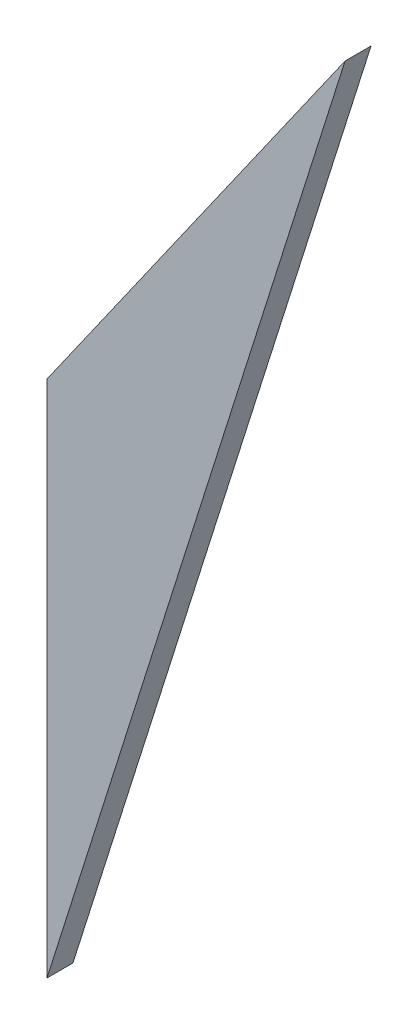
ISO-10303-21;
HEADER;
FILE_DESCRIPTION(('STEP AP214'),'2;1');
FILE_NAME('part.step','',(''),(''),'','','');
FILE_SCHEMA(('AUTOMOTIVE_DESIGN { 1 0 10303 214 1 1 1 1 }'));
ENDSEC;
DATA;
#1=APPLICATION_CONTEXT('core data for automotive mechanical design processes');
#2=APPLICATION_PROTOCOL_DEFINITION('international standard','automotive_design',2000,#1);
#3=PRODUCT_CONTEXT('',#1,'mechanical');
#4=PRODUCT('Part','Part','',(#3));
#5=PRODUCT_RELATED_PRODUCT_CATEGORY('part','',(#4));
#6=PRODUCT_DEFINITION_FORMATION('','',#4);
#7=PRODUCT_DEFINITION_CONTEXT('part definition',#1,'design');
#8=PRODUCT_DEFINITION('design','',#6,#7);
#9=PRODUCT_DEFINITION_SHAPE('','',#8);
#10=(LENGTH_UNIT() NAMED_UNIT(*) SI_UNIT(.MILLI.,.METRE.));
#11=(NAMED_UNIT(*) PLANE_ANGLE_UNIT() SI_UNIT($,.RADIAN.));
#12=(NAMED_UNIT(*) SI_UNIT($,.STERADIAN.) SOLID_ANGLE_UNIT());
#13=UNCERTAINTY_MEASURE_WITH_UNIT(LENGTH_MEASURE(1.E-05),#10,'distance_accuracy_value','');
#14=(GEOMETRIC_REPRESENTATION_CONTEXT(3) GLOBAL_UNCERTAINTY_ASSIGNED_CONTEXT((#13)) GLOBAL_UNIT_ASSIGNED_CONTEXT((#10,
#11,#12)) REPRESENTATION_CONTEXT('',''));
#15=CARTESIAN_POINT('',(0.,0.,0.));
#16=DIRECTION('',(0.,0.,1.));
#17=DIRECTION('',(1.,0.,0.));
#18=AXIS2_PLACEMENT_3D('',#15,#16,#17);
#19=CARTESIAN_POINT('',(-230.,10.0518212724248,-3.));
#20=DIRECTION('',(0.953508681455889,-0.301365549438307,0.));
#21=DIRECTION('',(0.301365549438307,0.953508681455889,0.));
#22=AXIS2_PLACEMENT_3D('',#19,#20,#21);
#23=PLANE('',#22);
#24=DIRECTION('',(0.301365549438307,0.953508681455889,0.));
#25=VECTOR('',#24,1.);
#26=CARTESIAN_POINT('',(-230.,10.0518212724248,0.));
#27=LINE('',#26,#25);
#28=CARTESIAN_POINT('',(-230.,10.0518212724248,0.));
#29=VERTEX_POINT('',#28);
#30=CARTESIAN_POINT('',(-195.517439878262,119.153277945835,0.));
#31=VERTEX_POINT('',#30);
#32=EDGE_CURVE('E85',#29,#31,#27,.T.);
#33=ORIENTED_EDGE('',*,*,#32,.F.);
#34=DIRECTION('',(0.,0.,1.));
#35=VECTOR('',#34,1.);
#36=CARTESIAN_POINT('',(-230.,10.0518212724248,-3.));
#37=LINE('',#36,#35);
#38=CARTESIAN_POINT('',(-230.,10.0518212724248,-3.));
#39=VERTEX_POINT('',#38);
#40=EDGE_CURVE('E11',#39,#29,#37,.T.);
#41=ORIENTED_EDGE('',*,*,#40,.F.);
#42=DIRECTION('',(0.301365549438307,0.953508681455889,0.));
#43=VECTOR('',#42,1.);
#44=CARTESIAN_POINT('',(-230.,10.0518212724248,-3.));
#45=LINE('',#44,#43);
#46=CARTESIAN_POINT('',(-195.517439878262,119.153277945835,-3.));
#47=VERTEX_POINT('',#46);
#48=EDGE_CURVE('E77',#39,#47,#45,.T.);
#49=ORIENTED_EDGE('',*,*,#48,.T.);
#50=DIRECTION('',(0.,0.,1.));
#51=VECTOR('',#50,1.);
#52=CARTESIAN_POINT('',(-195.517439878262,119.153277945835,-3.));
#53=LINE('',#52,#51);
#54=EDGE_CURVE('E36',#47,#31,#53,.T.);
#55=ORIENTED_EDGE('',*,*,#54,.T.);
#56=EDGE_LOOP('',(#33,#41,#49,#55));
#57=FACE_BOUND('',#56,.T.);
#58=ADVANCED_FACE('F33',(#57),#23,.T.);
#59=CARTESIAN_POINT('',(-230.,70.0518212724248,-3.));
#60=DIRECTION('',(-1.,0.,0.));
#61=DIRECTION('',(0.,0.,1.));
#62=AXIS2_PLACEMENT_3D('',#59,#60,#61);
#63=PLANE('',#62);
#64=DIRECTION('',(0.,-1.,0.));
#65=VECTOR('',#64,1.);
#66=CARTESIAN_POINT('',(-230.,70.0518212724248,0.));
#67=LINE('',#66,#65);
#68=CARTESIAN_POINT('',(-230.,70.0518212724248,0.));
#69=VERTEX_POINT('',#68);
#70=EDGE_CURVE('E79',#69,#29,#67,.T.);
#71=ORIENTED_EDGE('',*,*,#70,.F.);
#72=DIRECTION('',(0.,0.,1.));
#73=VECTOR('',#72,1.);
#74=CARTESIAN_POINT('',(-230.,70.0518212724248,-3.));
#75=LINE('',#74,#73);
#76=CARTESIAN_POINT('',(-230.,70.0518212724248,-3.));
#77=VERTEX_POINT('',#76);
#78=EDGE_CURVE('E42',#77,#69,#75,.T.);
#79=ORIENTED_EDGE('',*,*,#78,.F.);
#80=DIRECTION('',(0.,-1.,0.));
#81=VECTOR('',#80,1.);
#82=CARTESIAN_POINT('',(-230.,70.0518212724248,-3.));
#83=LINE('',#82,#81);
#84=EDGE_CURVE('E74',#77,#39,#83,.T.);
#85=ORIENTED_EDGE('',*,*,#84,.T.);
#86=ORIENTED_EDGE('',*,*,#40,.T.);
#87=EDGE_LOOP('',(#71,#79,#85,#86));
#88=FACE_BOUND('',#87,.T.);
#89=ADVANCED_FACE('F89',(#88),#63,.T.);
#90=CARTESIAN_POINT('',(-195.517439878262,119.153277945835,-3.));
#91=DIRECTION('',(-0.818357611223495,0.574709335362298,0.));
#92=DIRECTION('',(-0.574709335362298,-0.818357611223495,0.));
#93=AXIS2_PLACEMENT_3D('',#90,#91,#92);
#94=PLANE('',#93);
#95=DIRECTION('',(-0.574709335362298,-0.818357611223495,0.));
#96=VECTOR('',#95,1.);
#97=CARTESIAN_POINT('',(-195.517439878262,119.153277945835,0.));
#98=LINE('',#97,#96);
#99=EDGE_CURVE('E72',#31,#69,#98,.T.);
#100=ORIENTED_EDGE('',*,*,#99,.F.);
#101=ORIENTED_EDGE('',*,*,#54,.F.);
#102=DIRECTION('',(-0.574709335362298,-0.818357611223495,0.));
#103=VECTOR('',#102,1.);
#104=CARTESIAN_POINT('',(-195.517439878262,119.153277945835,-3.));
#105=LINE('',#104,#103);
#106=EDGE_CURVE('E70',#47,#77,#105,.T.);
#107=ORIENTED_EDGE('',*,*,#106,.T.);
#108=ORIENTED_EDGE('',*,*,#78,.T.);
#109=EDGE_LOOP('',(#100,#101,#107,#108));
#110=FACE_BOUND('',#109,.T.);
#111=ADVANCED_FACE('F69',(#110),#94,.T.);
#112=CARTESIAN_POINT('',(0.,0.,-3.));
#113=DIRECTION('',(0.,0.,1.));
#114=DIRECTION('',(1.,0.,0.));
#115=AXIS2_PLACEMENT_3D('',#112,#113,#114);
#116=PLANE('',#115);
#117=ORIENTED_EDGE('',*,*,#48,.F.);
#118=ORIENTED_EDGE('',*,*,#84,.F.);
#119=ORIENTED_EDGE('',*,*,#106,.F.);
#120=EDGE_LOOP('',(#117,#118,#119));
#121=FACE_BOUND('',#120,.T.);
#122=ADVANCED_FACE('F76',(#121),#116,.F.);
#123=CARTESIAN_POINT('',(0.,0.,0.));
#124=DIRECTION('',(0.,0.,1.));
#125=DIRECTION('',(1.,0.,0.));
#126=AXIS2_PLACEMENT_3D('',#123,#124,#125);
#127=PLANE('',#126);
#128=ORIENTED_EDGE('',*,*,#32,.T.);
#129=ORIENTED_EDGE('',*,*,#99,.T.);
#130=ORIENTED_EDGE('',*,*,#70,.T.);
#131=EDGE_LOOP('',(#128,#129,#130));
#132=FACE_BOUND('',#131,.T.);
#133=ADVANCED_FACE('F88',(#132),#127,.T.);
#134=CLOSED_SHELL('',(#58,#89,#111,#122,#133));
#135=MANIFOLD_SOLID_BREP('B2',#134);
#136=ADVANCED_BREP_SHAPE_REPRESENTATION('',(#18,#135),#14);
#137=SHAPE_DEFINITION_REPRESENTATION(#9,#136);
ENDSEC;
END-ISO-10303-21;
